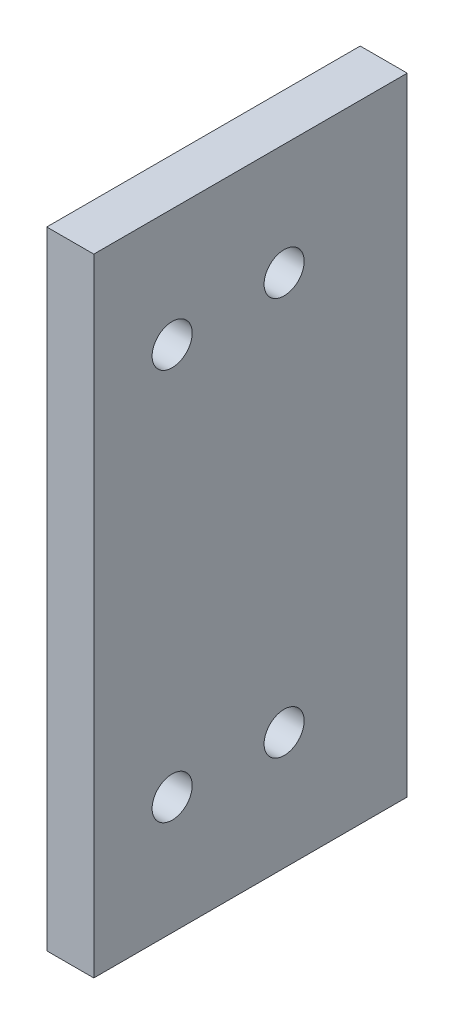
ISO-10303-21;
HEADER;
FILE_DESCRIPTION(('STEP AP214'),'2;1');
FILE_NAME('part.step','',(''),(''),'','','');
FILE_SCHEMA(('AUTOMOTIVE_DESIGN { 1 0 10303 214 1 1 1 1 }'));
ENDSEC;
DATA;
#1=APPLICATION_CONTEXT('core data for automotive mechanical design processes');
#2=APPLICATION_PROTOCOL_DEFINITION('international standard','automotive_design',2000,#1);
#3=PRODUCT_CONTEXT('',#1,'mechanical');
#4=PRODUCT('Part','Part','',(#3));
#5=PRODUCT_RELATED_PRODUCT_CATEGORY('part','',(#4));
#6=PRODUCT_DEFINITION_FORMATION('','',#4);
#7=PRODUCT_DEFINITION_CONTEXT('part definition',#1,'design');
#8=PRODUCT_DEFINITION('design','',#6,#7);
#9=PRODUCT_DEFINITION_SHAPE('','',#8);
#10=(LENGTH_UNIT() NAMED_UNIT(*) SI_UNIT(.MILLI.,.METRE.));
#11=(NAMED_UNIT(*) PLANE_ANGLE_UNIT() SI_UNIT($,.RADIAN.));
#12=(NAMED_UNIT(*) SI_UNIT($,.STERADIAN.) SOLID_ANGLE_UNIT());
#13=UNCERTAINTY_MEASURE_WITH_UNIT(LENGTH_MEASURE(1.E-05),#10,'distance_accuracy_value','');
#14=(GEOMETRIC_REPRESENTATION_CONTEXT(3) GLOBAL_UNCERTAINTY_ASSIGNED_CONTEXT((#13)) GLOBAL_UNIT_ASSIGNED_CONTEXT((#10,
#11,#12)) REPRESENTATION_CONTEXT('',''));
#15=CARTESIAN_POINT('',(0.,0.,0.));
#16=DIRECTION('',(0.,0.,1.));
#17=DIRECTION('',(1.,0.,0.));
#18=AXIS2_PLACEMENT_3D('',#15,#16,#17);
#19=CARTESIAN_POINT('',(6.,-40.,-20.));
#20=DIRECTION('',(0.,-1.,0.));
#21=DIRECTION('',(0.,0.,-1.));
#22=AXIS2_PLACEMENT_3D('',#19,#20,#21);
#23=PLANE('',#22);
#24=DIRECTION('',(0.,0.,1.));
#25=VECTOR('',#24,1.);
#26=CARTESIAN_POINT('',(0.,-40.,-20.));
#27=LINE('',#26,#25);
#28=CARTESIAN_POINT('',(0.,-40.,-20.));
#29=VERTEX_POINT('',#28);
#30=CARTESIAN_POINT('',(0.,-40.,20.));
#31=VERTEX_POINT('',#30);
#32=EDGE_CURVE('E105',#29,#31,#27,.T.);
#33=ORIENTED_EDGE('',*,*,#32,.F.);
#34=DIRECTION('',(-1.,0.,0.));
#35=VECTOR('',#34,1.);
#36=CARTESIAN_POINT('',(6.,-40.,-20.));
#37=LINE('',#36,#35);
#38=CARTESIAN_POINT('',(6.,-40.,-20.));
#39=VERTEX_POINT('',#38);
#40=EDGE_CURVE('E11',#39,#29,#37,.T.);
#41=ORIENTED_EDGE('',*,*,#40,.F.);
#42=DIRECTION('',(0.,0.,1.));
#43=VECTOR('',#42,1.);
#44=CARTESIAN_POINT('',(6.,-40.,-20.));
#45=LINE('',#44,#43);
#46=CARTESIAN_POINT('',(6.,-40.,20.));
#47=VERTEX_POINT('',#46);
#48=EDGE_CURVE('E99',#39,#47,#45,.T.);
#49=ORIENTED_EDGE('',*,*,#48,.T.);
#50=DIRECTION('',(-1.,0.,0.));
#51=VECTOR('',#50,1.);
#52=CARTESIAN_POINT('',(6.,-40.,20.));
#53=LINE('',#52,#51);
#54=EDGE_CURVE('E42',#47,#31,#53,.T.);
#55=ORIENTED_EDGE('',*,*,#54,.T.);
#56=EDGE_LOOP('',(#33,#41,#49,#55));
#57=FACE_BOUND('',#56,.T.);
#58=ADVANCED_FACE('F39',(#57),#23,.T.);
#59=CARTESIAN_POINT('',(6.,-40.,-20.));
#60=DIRECTION('',(0.,0.,1.));
#61=DIRECTION('',(1.,0.,0.));
#62=AXIS2_PLACEMENT_3D('',#59,#60,#61);
#63=PLANE('',#62);
#64=DIRECTION('',(0.,1.,0.));
#65=VECTOR('',#64,1.);
#66=CARTESIAN_POINT('',(0.,-40.,-20.));
#67=LINE('',#66,#65);
#68=CARTESIAN_POINT('',(0.,40.,-20.));
#69=VERTEX_POINT('',#68);
#70=EDGE_CURVE('E72',#29,#69,#67,.T.);
#71=ORIENTED_EDGE('',*,*,#70,.T.);
#72=DIRECTION('',(-1.,0.,0.));
#73=VECTOR('',#72,1.);
#74=CARTESIAN_POINT('',(6.,40.,-20.));
#75=LINE('',#74,#73);
#76=CARTESIAN_POINT('',(6.,40.,-20.));
#77=VERTEX_POINT('',#76);
#78=EDGE_CURVE('E48',#77,#69,#75,.T.);
#79=ORIENTED_EDGE('',*,*,#78,.F.);
#80=DIRECTION('',(0.,1.,0.));
#81=VECTOR('',#80,1.);
#82=CARTESIAN_POINT('',(6.,-40.,-20.));
#83=LINE('',#82,#81);
#84=EDGE_CURVE('E89',#39,#77,#83,.T.);
#85=ORIENTED_EDGE('',*,*,#84,.F.);
#86=ORIENTED_EDGE('',*,*,#40,.T.);
#87=EDGE_LOOP('',(#71,#79,#85,#86));
#88=FACE_BOUND('',#87,.T.);
#89=ADVANCED_FACE('F116',(#88),#63,.F.);
#90=CARTESIAN_POINT('',(6.,40.,-20.));
#91=DIRECTION('',(0.,-1.,0.));
#92=DIRECTION('',(0.,0.,-1.));
#93=AXIS2_PLACEMENT_3D('',#90,#91,#92);
#94=PLANE('',#93);
#95=DIRECTION('',(0.,0.,1.));
#96=VECTOR('',#95,1.);
#97=CARTESIAN_POINT('',(0.,40.,-20.));
#98=LINE('',#97,#96);
#99=CARTESIAN_POINT('',(0.,40.,20.));
#100=VERTEX_POINT('',#99);
#101=EDGE_CURVE('E96',#69,#100,#98,.T.);
#102=ORIENTED_EDGE('',*,*,#101,.T.);
#103=DIRECTION('',(-1.,0.,0.));
#104=VECTOR('',#103,1.);
#105=CARTESIAN_POINT('',(6.,40.,20.));
#106=LINE('',#105,#104);
#107=CARTESIAN_POINT('',(6.,40.,20.));
#108=VERTEX_POINT('',#107);
#109=EDGE_CURVE('E93',#108,#100,#106,.T.);
#110=ORIENTED_EDGE('',*,*,#109,.F.);
#111=DIRECTION('',(0.,0.,1.));
#112=VECTOR('',#111,1.);
#113=CARTESIAN_POINT('',(6.,40.,-20.));
#114=LINE('',#113,#112);
#115=EDGE_CURVE('E84',#77,#108,#114,.T.);
#116=ORIENTED_EDGE('',*,*,#115,.F.);
#117=ORIENTED_EDGE('',*,*,#78,.T.);
#118=EDGE_LOOP('',(#102,#110,#116,#117));
#119=FACE_BOUND('',#118,.T.);
#120=ADVANCED_FACE('F94',(#119),#94,.F.);
#121=CARTESIAN_POINT('',(6.,-40.,20.));
#122=DIRECTION('',(0.,0.,1.));
#123=DIRECTION('',(1.,0.,0.));
#124=AXIS2_PLACEMENT_3D('',#121,#122,#123);
#125=PLANE('',#124);
#126=DIRECTION('',(0.,1.,0.));
#127=VECTOR('',#126,1.);
#128=CARTESIAN_POINT('',(0.,-40.,20.));
#129=LINE('',#128,#127);
#130=EDGE_CURVE('E108',#31,#100,#129,.T.);
#131=ORIENTED_EDGE('',*,*,#130,.F.);
#132=ORIENTED_EDGE('',*,*,#54,.F.);
#133=DIRECTION('',(0.,1.,0.));
#134=VECTOR('',#133,1.);
#135=CARTESIAN_POINT('',(6.,-40.,20.));
#136=LINE('',#135,#134);
#137=EDGE_CURVE('E88',#47,#108,#136,.T.);
#138=ORIENTED_EDGE('',*,*,#137,.T.);
#139=ORIENTED_EDGE('',*,*,#109,.T.);
#140=EDGE_LOOP('',(#131,#132,#138,#139));
#141=FACE_BOUND('',#140,.T.);
#142=ADVANCED_FACE('F98',(#141),#125,.T.);
#143=CARTESIAN_POINT('',(6.,0.,0.));
#144=DIRECTION('',(-1.,0.,0.));
#145=DIRECTION('',(0.,0.,1.));
#146=AXIS2_PLACEMENT_3D('',#143,#144,#145);
#147=PLANE('',#146);
#148=CARTESIAN_POINT('',(6.,25.,10.));
#149=DIRECTION('',(-1.,0.,0.));
#150=DIRECTION('',(0.,0.,1.));
#151=AXIS2_PLACEMENT_3D('',#148,#149,#150);
#152=CIRCLE('',#151,2.555);
#153=CARTESIAN_POINT('',(6.,25.,12.555));
#154=VERTEX_POINT('',#153);
#155=EDGE_CURVE('E175',#154,#154,#152,.T.);
#156=ORIENTED_EDGE('',*,*,#155,.T.);
#157=EDGE_LOOP('',(#156));
#158=FACE_BOUND('',#157,.T.);
#159=CARTESIAN_POINT('',(6.,-25.,10.));
#160=DIRECTION('',(-1.,0.,0.));
#161=DIRECTION('',(0.,0.,1.));
#162=AXIS2_PLACEMENT_3D('',#159,#160,#161);
#163=CIRCLE('',#162,2.555);
#164=CARTESIAN_POINT('',(6.,-25.,12.555));
#165=VERTEX_POINT('',#164);
#166=EDGE_CURVE('E167',#165,#165,#163,.T.);
#167=ORIENTED_EDGE('',*,*,#166,.T.);
#168=EDGE_LOOP('',(#167));
#169=FACE_BOUND('',#168,.T.);
#170=CARTESIAN_POINT('',(6.,-25.,-4.29));
#171=DIRECTION('',(-1.,0.,0.));
#172=DIRECTION('',(0.,0.,1.));
#173=AXIS2_PLACEMENT_3D('',#170,#171,#172);
#174=CIRCLE('',#173,2.555);
#175=CARTESIAN_POINT('',(6.,-25.,-1.735));
#176=VERTEX_POINT('',#175);
#177=EDGE_CURVE('E162',#176,#176,#174,.T.);
#178=ORIENTED_EDGE('',*,*,#177,.T.);
#179=EDGE_LOOP('',(#178));
#180=FACE_BOUND('',#179,.T.);
#181=CARTESIAN_POINT('',(6.,25.8,-4.29));
#182=DIRECTION('',(-1.,0.,0.));
#183=DIRECTION('',(0.,0.,1.));
#184=AXIS2_PLACEMENT_3D('',#181,#182,#183);
#185=CIRCLE('',#184,2.555);
#186=CARTESIAN_POINT('',(6.,25.8,-1.73499999999999));
#187=VERTEX_POINT('',#186);
#188=EDGE_CURVE('E164',#187,#187,#185,.T.);
#189=ORIENTED_EDGE('',*,*,#188,.T.);
#190=EDGE_LOOP('',(#189));
#191=FACE_BOUND('',#190,.T.);
#192=ORIENTED_EDGE('',*,*,#48,.F.);
#193=ORIENTED_EDGE('',*,*,#84,.T.);
#194=ORIENTED_EDGE('',*,*,#115,.T.);
#195=ORIENTED_EDGE('',*,*,#137,.F.);
#196=EDGE_LOOP('',(#192,#193,#194,#195));
#197=FACE_BOUND('',#196,.T.);
#198=ADVANCED_FACE('F87',(#158,#169,#180,#191,#197),#147,.F.);
#199=CARTESIAN_POINT('',(0.,0.,0.));
#200=DIRECTION('',(-1.,0.,0.));
#201=DIRECTION('',(0.,0.,1.));
#202=AXIS2_PLACEMENT_3D('',#199,#200,#201);
#203=PLANE('',#202);
#204=CARTESIAN_POINT('',(0.,25.,10.));
#205=DIRECTION('',(1.,0.,0.));
#206=DIRECTION('',(0.,0.,-1.));
#207=AXIS2_PLACEMENT_3D('',#204,#205,#206);
#208=CIRCLE('',#207,2.555);
#209=CARTESIAN_POINT('',(0.,25.,7.445));
#210=VERTEX_POINT('',#209);
#211=EDGE_CURVE('E177',#210,#210,#208,.T.);
#212=ORIENTED_EDGE('',*,*,#211,.T.);
#213=EDGE_LOOP('',(#212));
#214=FACE_BOUND('',#213,.T.);
#215=CARTESIAN_POINT('',(0.,-25.,10.));
#216=DIRECTION('',(1.,0.,0.));
#217=DIRECTION('',(0.,0.,-1.));
#218=AXIS2_PLACEMENT_3D('',#215,#216,#217);
#219=CIRCLE('',#218,2.555);
#220=CARTESIAN_POINT('',(0.,-25.,7.445));
#221=VERTEX_POINT('',#220);
#222=EDGE_CURVE('E172',#221,#221,#219,.T.);
#223=ORIENTED_EDGE('',*,*,#222,.T.);
#224=EDGE_LOOP('',(#223));
#225=FACE_BOUND('',#224,.T.);
#226=CARTESIAN_POINT('',(0.,-25.,-4.29));
#227=DIRECTION('',(1.,0.,0.));
#228=DIRECTION('',(0.,0.,-1.));
#229=AXIS2_PLACEMENT_3D('',#226,#227,#228);
#230=CIRCLE('',#229,2.555);
#231=CARTESIAN_POINT('',(0.,-25.,-6.84499999999999));
#232=VERTEX_POINT('',#231);
#233=EDGE_CURVE('E159',#232,#232,#230,.T.);
#234=ORIENTED_EDGE('',*,*,#233,.T.);
#235=EDGE_LOOP('',(#234));
#236=FACE_BOUND('',#235,.T.);
#237=CARTESIAN_POINT('',(0.,25.8,-4.29));
#238=DIRECTION('',(1.,0.,0.));
#239=DIRECTION('',(0.,0.,-1.));
#240=AXIS2_PLACEMENT_3D('',#237,#238,#239);
#241=CIRCLE('',#240,2.555);
#242=CARTESIAN_POINT('',(0.,25.8,-6.845));
#243=VERTEX_POINT('',#242);
#244=EDGE_CURVE('E109',#243,#243,#241,.T.);
#245=ORIENTED_EDGE('',*,*,#244,.T.);
#246=EDGE_LOOP('',(#245));
#247=FACE_BOUND('',#246,.T.);
#248=ORIENTED_EDGE('',*,*,#32,.T.);
#249=ORIENTED_EDGE('',*,*,#130,.T.);
#250=ORIENTED_EDGE('',*,*,#101,.F.);
#251=ORIENTED_EDGE('',*,*,#70,.F.);
#252=EDGE_LOOP('',(#248,#249,#250,#251));
#253=FACE_BOUND('',#252,.T.);
#254=ADVANCED_FACE('F114',(#214,#225,#236,#247,#253),#203,.T.);
#255=CARTESIAN_POINT('',(6.001,25.8,-4.29));
#256=DIRECTION('',(-1.,0.,0.));
#257=DIRECTION('',(0.,0.,1.));
#258=AXIS2_PLACEMENT_3D('',#255,#256,#257);
#259=CYLINDRICAL_SURFACE('',#258,2.555);
#260=ORIENTED_EDGE('',*,*,#244,.F.);
#261=EDGE_LOOP('',(#260));
#262=FACE_BOUND('',#261,.T.);
#263=ORIENTED_EDGE('',*,*,#188,.F.);
#264=EDGE_LOOP('',(#263));
#265=FACE_BOUND('',#264,.T.);
#266=ADVANCED_FACE('F135',(#262,#265),#259,.F.);
#267=CARTESIAN_POINT('',(6.001,-25.,-4.29));
#268=DIRECTION('',(-1.,0.,0.));
#269=DIRECTION('',(0.,0.,1.));
#270=AXIS2_PLACEMENT_3D('',#267,#268,#269);
#271=CYLINDRICAL_SURFACE('',#270,2.555);
#272=ORIENTED_EDGE('',*,*,#233,.F.);
#273=EDGE_LOOP('',(#272));
#274=FACE_BOUND('',#273,.T.);
#275=ORIENTED_EDGE('',*,*,#177,.F.);
#276=EDGE_LOOP('',(#275));
#277=FACE_BOUND('',#276,.T.);
#278=ADVANCED_FACE('F142',(#274,#277),#271,.F.);
#279=CARTESIAN_POINT('',(6.001,-25.,10.));
#280=DIRECTION('',(-1.,0.,0.));
#281=DIRECTION('',(0.,0.,1.));
#282=AXIS2_PLACEMENT_3D('',#279,#280,#281);
#283=CYLINDRICAL_SURFACE('',#282,2.555);
#284=ORIENTED_EDGE('',*,*,#222,.F.);
#285=EDGE_LOOP('',(#284));
#286=FACE_BOUND('',#285,.T.);
#287=ORIENTED_EDGE('',*,*,#166,.F.);
#288=EDGE_LOOP('',(#287));
#289=FACE_BOUND('',#288,.T.);
#290=ADVANCED_FACE('F147',(#286,#289),#283,.F.);
#291=CARTESIAN_POINT('',(6.001,25.,10.));
#292=DIRECTION('',(-1.,0.,0.));
#293=DIRECTION('',(0.,0.,1.));
#294=AXIS2_PLACEMENT_3D('',#291,#292,#293);
#295=CYLINDRICAL_SURFACE('',#294,2.555);
#296=ORIENTED_EDGE('',*,*,#211,.F.);
#297=EDGE_LOOP('',(#296));
#298=FACE_BOUND('',#297,.T.);
#299=ORIENTED_EDGE('',*,*,#155,.F.);
#300=EDGE_LOOP('',(#299));
#301=FACE_BOUND('',#300,.T.);
#302=ADVANCED_FACE('F144',(#298,#301),#295,.F.);
#303=CLOSED_SHELL('',(#58,#89,#120,#142,#198,#254,#266,#278,#290,#302));
#304=MANIFOLD_SOLID_BREP('B2',#303);
#305=ADVANCED_BREP_SHAPE_REPRESENTATION('',(#18,#304),#14);
#306=SHAPE_DEFINITION_REPRESENTATION(#9,#305);
ENDSEC;
END-ISO-10303-21;
